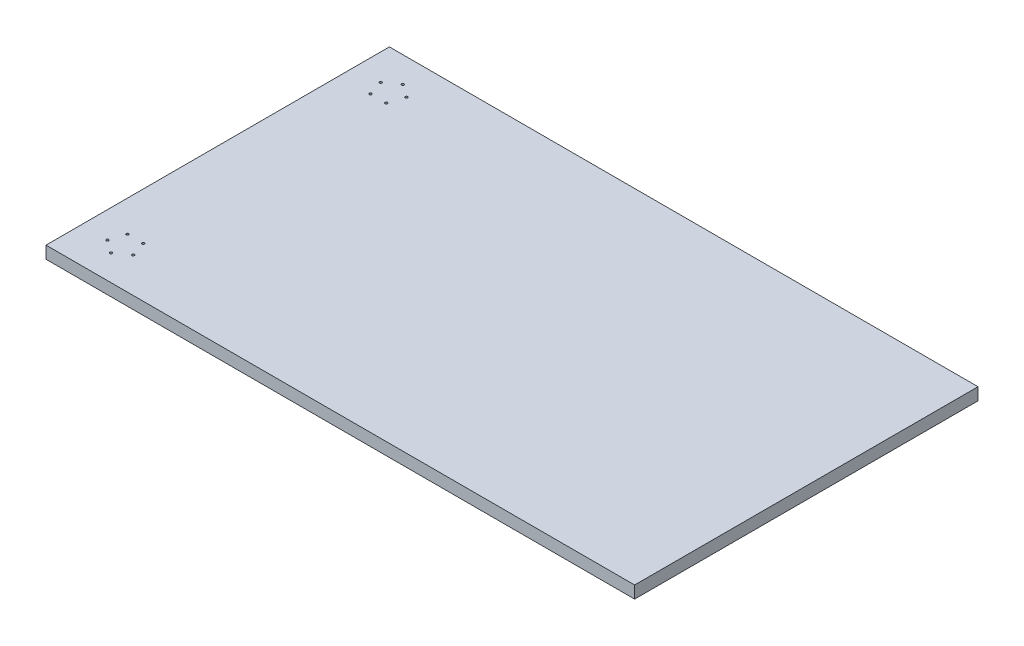
ISO-10303-21;
HEADER;
FILE_DESCRIPTION(('STEP AP214'),'2;1');
FILE_NAME('part.step','',(''),(''),'','','');
FILE_SCHEMA(('AUTOMOTIVE_DESIGN { 1 0 10303 214 1 1 1 1 }'));
ENDSEC;
DATA;
#1=APPLICATION_CONTEXT('core data for automotive mechanical design processes');
#2=APPLICATION_PROTOCOL_DEFINITION('international standard','automotive_design',2000,#1);
#3=PRODUCT_CONTEXT('',#1,'mechanical');
#4=PRODUCT('Part','Part','',(#3));
#5=PRODUCT_RELATED_PRODUCT_CATEGORY('part','',(#4));
#6=PRODUCT_DEFINITION_FORMATION('','',#4);
#7=PRODUCT_DEFINITION_CONTEXT('part definition',#1,'design');
#8=PRODUCT_DEFINITION('design','',#6,#7);
#9=PRODUCT_DEFINITION_SHAPE('','',#8);
#10=(LENGTH_UNIT() NAMED_UNIT(*) SI_UNIT(.MILLI.,.METRE.));
#11=(NAMED_UNIT(*) PLANE_ANGLE_UNIT() SI_UNIT($,.RADIAN.));
#12=(NAMED_UNIT(*) SI_UNIT($,.STERADIAN.) SOLID_ANGLE_UNIT());
#13=UNCERTAINTY_MEASURE_WITH_UNIT(LENGTH_MEASURE(1.E-05),#10,'distance_accuracy_value','');
#14=(GEOMETRIC_REPRESENTATION_CONTEXT(3) GLOBAL_UNCERTAINTY_ASSIGNED_CONTEXT((#13)) GLOBAL_UNIT_ASSIGNED_CONTEXT((#10,
#11,#12)) REPRESENTATION_CONTEXT('',''));
#15=CARTESIAN_POINT('',(0.,0.,0.));
#16=DIRECTION('',(0.,0.,1.));
#17=DIRECTION('',(1.,0.,0.));
#18=AXIS2_PLACEMENT_3D('',#15,#16,#17);
#19=CARTESIAN_POINT('',(-600.,25.,-350.));
#20=DIRECTION('',(0.,0.,-1.));
#21=DIRECTION('',(-1.,0.,0.));
#22=AXIS2_PLACEMENT_3D('',#19,#20,#21);
#23=PLANE('',#22);
#24=DIRECTION('',(1.,0.,0.));
#25=VECTOR('',#24,1.);
#26=CARTESIAN_POINT('',(-600.,0.,-350.));
#27=LINE('',#26,#25);
#28=CARTESIAN_POINT('',(-600.,0.,-350.));
#29=VERTEX_POINT('',#28);
#30=CARTESIAN_POINT('',(600.,0.,-350.));
#31=VERTEX_POINT('',#30);
#32=EDGE_CURVE('E176',#29,#31,#27,.T.);
#33=ORIENTED_EDGE('',*,*,#32,.F.);
#34=DIRECTION('',(0.,-1.,0.));
#35=VECTOR('',#34,1.);
#36=CARTESIAN_POINT('',(-600.,25.,-350.));
#37=LINE('',#36,#35);
#38=CARTESIAN_POINT('',(-600.,25.,-350.));
#39=VERTEX_POINT('',#38);
#40=EDGE_CURVE('E11',#39,#29,#37,.T.);
#41=ORIENTED_EDGE('',*,*,#40,.F.);
#42=DIRECTION('',(1.,0.,0.));
#43=VECTOR('',#42,1.);
#44=CARTESIAN_POINT('',(-600.,25.,-350.));
#45=LINE('',#44,#43);
#46=CARTESIAN_POINT('',(600.,25.,-350.));
#47=VERTEX_POINT('',#46);
#48=EDGE_CURVE('E177',#39,#47,#45,.T.);
#49=ORIENTED_EDGE('',*,*,#48,.T.);
#50=DIRECTION('',(0.,-1.,0.));
#51=VECTOR('',#50,1.);
#52=CARTESIAN_POINT('',(600.,25.,-350.));
#53=LINE('',#52,#51);
#54=EDGE_CURVE('E35',#47,#31,#53,.T.);
#55=ORIENTED_EDGE('',*,*,#54,.T.);
#56=EDGE_LOOP('',(#33,#41,#49,#55));
#57=FACE_BOUND('',#56,.T.);
#58=ADVANCED_FACE('F32',(#57),#23,.T.);
#59=CARTESIAN_POINT('',(-600.,25.,350.));
#60=DIRECTION('',(-1.,0.,0.));
#61=DIRECTION('',(0.,0.,1.));
#62=AXIS2_PLACEMENT_3D('',#59,#60,#61);
#63=PLANE('',#62);
#64=DIRECTION('',(0.,0.,-1.));
#65=VECTOR('',#64,1.);
#66=CARTESIAN_POINT('',(-600.,0.,350.));
#67=LINE('',#66,#65);
#68=CARTESIAN_POINT('',(-600.,0.,350.));
#69=VERTEX_POINT('',#68);
#70=EDGE_CURVE('E179',#69,#29,#67,.T.);
#71=ORIENTED_EDGE('',*,*,#70,.F.);
#72=DIRECTION('',(0.,-1.,0.));
#73=VECTOR('',#72,1.);
#74=CARTESIAN_POINT('',(-600.,25.,350.));
#75=LINE('',#74,#73);
#76=CARTESIAN_POINT('',(-600.,25.,350.));
#77=VERTEX_POINT('',#76);
#78=EDGE_CURVE('E41',#77,#69,#75,.T.);
#79=ORIENTED_EDGE('',*,*,#78,.F.);
#80=DIRECTION('',(0.,0.,-1.));
#81=VECTOR('',#80,1.);
#82=CARTESIAN_POINT('',(-600.,25.,350.));
#83=LINE('',#82,#81);
#84=EDGE_CURVE('E183',#77,#39,#83,.T.);
#85=ORIENTED_EDGE('',*,*,#84,.T.);
#86=ORIENTED_EDGE('',*,*,#40,.T.);
#87=EDGE_LOOP('',(#71,#79,#85,#86));
#88=FACE_BOUND('',#87,.T.);
#89=ADVANCED_FACE('F202',(#88),#63,.T.);
#90=CARTESIAN_POINT('',(-600.,25.,350.));
#91=DIRECTION('',(0.,0.,-1.));
#92=DIRECTION('',(-1.,0.,0.));
#93=AXIS2_PLACEMENT_3D('',#90,#91,#92);
#94=PLANE('',#93);
#95=DIRECTION('',(1.,0.,0.));
#96=VECTOR('',#95,1.);
#97=CARTESIAN_POINT('',(-600.,0.,350.));
#98=LINE('',#97,#96);
#99=CARTESIAN_POINT('',(600.,0.,350.));
#100=VERTEX_POINT('',#99);
#101=EDGE_CURVE('E190',#69,#100,#98,.T.);
#102=ORIENTED_EDGE('',*,*,#101,.T.);
#103=DIRECTION('',(0.,-1.,0.));
#104=VECTOR('',#103,1.);
#105=CARTESIAN_POINT('',(600.,25.,350.));
#106=LINE('',#105,#104);
#107=CARTESIAN_POINT('',(600.,25.,350.));
#108=VERTEX_POINT('',#107);
#109=EDGE_CURVE('E194',#108,#100,#106,.T.);
#110=ORIENTED_EDGE('',*,*,#109,.F.);
#111=DIRECTION('',(1.,0.,0.));
#112=VECTOR('',#111,1.);
#113=CARTESIAN_POINT('',(-600.,25.,350.));
#114=LINE('',#113,#112);
#115=EDGE_CURVE('E181',#77,#108,#114,.T.);
#116=ORIENTED_EDGE('',*,*,#115,.F.);
#117=ORIENTED_EDGE('',*,*,#78,.T.);
#118=EDGE_LOOP('',(#102,#110,#116,#117));
#119=FACE_BOUND('',#118,.T.);
#120=ADVANCED_FACE('F204',(#119),#94,.F.);
#121=CARTESIAN_POINT('',(600.,25.,350.));
#122=DIRECTION('',(-1.,0.,0.));
#123=DIRECTION('',(0.,0.,1.));
#124=AXIS2_PLACEMENT_3D('',#121,#122,#123);
#125=PLANE('',#124);
#126=DIRECTION('',(0.,0.,-1.));
#127=VECTOR('',#126,1.);
#128=CARTESIAN_POINT('',(600.,0.,350.));
#129=LINE('',#128,#127);
#130=EDGE_CURVE('E187',#100,#31,#129,.T.);
#131=ORIENTED_EDGE('',*,*,#130,.T.);
#132=ORIENTED_EDGE('',*,*,#54,.F.);
#133=DIRECTION('',(0.,0.,-1.));
#134=VECTOR('',#133,1.);
#135=CARTESIAN_POINT('',(600.,25.,350.));
#136=LINE('',#135,#134);
#137=EDGE_CURVE('E75',#108,#47,#136,.T.);
#138=ORIENTED_EDGE('',*,*,#137,.F.);
#139=ORIENTED_EDGE('',*,*,#109,.T.);
#140=EDGE_LOOP('',(#131,#132,#138,#139));
#141=FACE_BOUND('',#140,.T.);
#142=ADVANCED_FACE('F199',(#141),#125,.F.);
#143=CARTESIAN_POINT('',(0.,25.,0.));
#144=DIRECTION('',(0.,1.,0.));
#145=DIRECTION('',(0.,0.,1.));
#146=AXIS2_PLACEMENT_3D('',#143,#144,#145);
#147=PLANE('',#146);
#148=CARTESIAN_POINT('',(-493.845945801883,25.,-278.497967345312));
#149=DIRECTION('',(0.,1.,0.));
#150=DIRECTION('',(0.,0.,1.));
#151=AXIS2_PLACEMENT_3D('',#148,#149,#150);
#152=CIRCLE('',#151,2.5);
#153=CARTESIAN_POINT('',(-493.845945801883,25.,-275.997967345312));
#154=VERTEX_POINT('',#153);
#155=EDGE_CURVE('E118',#154,#154,#152,.T.);
#156=ORIENTED_EDGE('',*,*,#155,.F.);
#157=EDGE_LOOP('',(#156));
#158=FACE_BOUND('',#157,.T.);
#159=CARTESIAN_POINT('',(-520.,25.,-297.5));
#160=DIRECTION('',(0.,1.,0.));
#161=DIRECTION('',(0.,0.,1.));
#162=AXIS2_PLACEMENT_3D('',#159,#160,#161);
#163=CIRCLE('',#162,2.49999999999995);
#164=CARTESIAN_POINT('',(-520.,25.,-295.));
#165=VERTEX_POINT('',#164);
#166=EDGE_CURVE('E117',#165,#165,#163,.T.);
#167=ORIENTED_EDGE('',*,*,#166,.F.);
#168=EDGE_LOOP('',(#167));
#169=FACE_BOUND('',#168,.T.);
#170=CARTESIAN_POINT('',(-546.154054198116,25.,-278.49796734531));
#171=DIRECTION('',(0.,1.,0.));
#172=DIRECTION('',(0.,0.,1.));
#173=AXIS2_PLACEMENT_3D('',#170,#171,#172);
#174=CIRCLE('',#173,2.49999999999995);
#175=CARTESIAN_POINT('',(-546.154054198116,25.,-275.99796734531));
#176=VERTEX_POINT('',#175);
#177=EDGE_CURVE('E128',#176,#176,#174,.T.);
#178=ORIENTED_EDGE('',*,*,#177,.F.);
#179=EDGE_LOOP('',(#178));
#180=FACE_BOUND('',#179,.T.);
#181=CARTESIAN_POINT('',(-536.164094438041,25.,-247.752032654688));
#182=DIRECTION('',(0.,1.,0.));
#183=DIRECTION('',(0.,0.,1.));
#184=AXIS2_PLACEMENT_3D('',#181,#182,#183);
#185=CIRCLE('',#184,2.49999999999995);
#186=CARTESIAN_POINT('',(-536.164094438041,25.,-245.252032654688));
#187=VERTEX_POINT('',#186);
#188=EDGE_CURVE('E134',#187,#187,#185,.T.);
#189=ORIENTED_EDGE('',*,*,#188,.F.);
#190=EDGE_LOOP('',(#189));
#191=FACE_BOUND('',#190,.T.);
#192=CARTESIAN_POINT('',(-503.835905561955,25.,-247.752032654689));
#193=DIRECTION('',(0.,1.,0.));
#194=DIRECTION('',(0.,0.,1.));
#195=AXIS2_PLACEMENT_3D('',#192,#193,#194);
#196=CIRCLE('',#195,2.49999999999995);
#197=CARTESIAN_POINT('',(-503.835905561955,25.,-245.25203265469));
#198=VERTEX_POINT('',#197);
#199=EDGE_CURVE('E140',#198,#198,#196,.T.);
#200=ORIENTED_EDGE('',*,*,#199,.F.);
#201=EDGE_LOOP('',(#200));
#202=FACE_BOUND('',#201,.T.);
#203=CARTESIAN_POINT('',(-493.845945801883,25.,278.497967345312));
#204=DIRECTION('',(0.,1.,0.));
#205=DIRECTION('',(0.,0.,1.));
#206=AXIS2_PLACEMENT_3D('',#203,#204,#205);
#207=CIRCLE('',#206,2.5);
#208=CARTESIAN_POINT('',(-493.845945801883,25.,280.997967345312));
#209=VERTEX_POINT('',#208);
#210=EDGE_CURVE('E146',#209,#209,#207,.T.);
#211=ORIENTED_EDGE('',*,*,#210,.F.);
#212=EDGE_LOOP('',(#211));
#213=FACE_BOUND('',#212,.T.);
#214=CARTESIAN_POINT('',(-503.835905561955,25.,247.752032654689));
#215=DIRECTION('',(0.,1.,0.));
#216=DIRECTION('',(0.,0.,1.));
#217=AXIS2_PLACEMENT_3D('',#214,#215,#216);
#218=CIRCLE('',#217,2.49999999999995);
#219=CARTESIAN_POINT('',(-503.835905561955,25.,250.252032654689));
#220=VERTEX_POINT('',#219);
#221=EDGE_CURVE('E152',#220,#220,#218,.T.);
#222=ORIENTED_EDGE('',*,*,#221,.F.);
#223=EDGE_LOOP('',(#222));
#224=FACE_BOUND('',#223,.T.);
#225=CARTESIAN_POINT('',(-536.164094438041,25.,247.752032654688));
#226=DIRECTION('',(0.,1.,0.));
#227=DIRECTION('',(0.,0.,1.));
#228=AXIS2_PLACEMENT_3D('',#225,#226,#227);
#229=CIRCLE('',#228,2.49999999999995);
#230=CARTESIAN_POINT('',(-536.164094438041,25.,250.252032654688));
#231=VERTEX_POINT('',#230);
#232=EDGE_CURVE('E158',#231,#231,#229,.T.);
#233=ORIENTED_EDGE('',*,*,#232,.F.);
#234=EDGE_LOOP('',(#233));
#235=FACE_BOUND('',#234,.T.);
#236=CARTESIAN_POINT('',(-546.154054198116,25.,278.49796734531));
#237=DIRECTION('',(0.,1.,0.));
#238=DIRECTION('',(0.,0.,1.));
#239=AXIS2_PLACEMENT_3D('',#236,#237,#238);
#240=CIRCLE('',#239,2.49999999999995);
#241=CARTESIAN_POINT('',(-546.154054198116,25.,280.99796734531));
#242=VERTEX_POINT('',#241);
#243=EDGE_CURVE('E164',#242,#242,#240,.T.);
#244=ORIENTED_EDGE('',*,*,#243,.F.);
#245=EDGE_LOOP('',(#244));
#246=FACE_BOUND('',#245,.T.);
#247=CARTESIAN_POINT('',(-520.,25.,297.5));
#248=DIRECTION('',(0.,1.,0.));
#249=DIRECTION('',(0.,0.,1.));
#250=AXIS2_PLACEMENT_3D('',#247,#248,#249);
#251=CIRCLE('',#250,2.49999999999995);
#252=CARTESIAN_POINT('',(-520.,25.,300.));
#253=VERTEX_POINT('',#252);
#254=EDGE_CURVE('E170',#253,#253,#251,.T.);
#255=ORIENTED_EDGE('',*,*,#254,.F.);
#256=EDGE_LOOP('',(#255));
#257=FACE_BOUND('',#256,.T.);
#258=ORIENTED_EDGE('',*,*,#48,.F.);
#259=ORIENTED_EDGE('',*,*,#84,.F.);
#260=ORIENTED_EDGE('',*,*,#115,.T.);
#261=ORIENTED_EDGE('',*,*,#137,.T.);
#262=EDGE_LOOP('',(#258,#259,#260,#261));
#263=FACE_BOUND('',#262,.T.);
#264=ADVANCED_FACE('F205',(#158,#169,#180,#191,#202,#213,#224,#235,#246,#257,#263),#147,.T.);
#265=CARTESIAN_POINT('',(0.,0.,0.));
#266=DIRECTION('',(0.,1.,0.));
#267=DIRECTION('',(0.,0.,1.));
#268=AXIS2_PLACEMENT_3D('',#265,#266,#267);
#269=PLANE('',#268);
#270=ORIENTED_EDGE('',*,*,#32,.T.);
#271=ORIENTED_EDGE('',*,*,#130,.F.);
#272=ORIENTED_EDGE('',*,*,#101,.F.);
#273=ORIENTED_EDGE('',*,*,#70,.T.);
#274=EDGE_LOOP('',(#270,#271,#272,#273));
#275=FACE_BOUND('',#274,.T.);
#276=ADVANCED_FACE('F201',(#275),#269,.F.);
#277=CARTESIAN_POINT('',(-520.,10.,297.5));
#278=DIRECTION('',(0.,1.,0.));
#279=DIRECTION('',(0.,0.,1.));
#280=AXIS2_PLACEMENT_3D('',#277,#278,#279);
#281=CONICAL_SURFACE('',#280,2.49999999999995,1.02974425867665);
#282=CARTESIAN_POINT('',(-520.,8.4978484524311,297.5));
#283=VERTEX_POINT('',#282);
#284=VERTEX_LOOP('',#283);
#285=FACE_BOUND('',#284,.T.);
#286=CARTESIAN_POINT('',(-520.,10.,297.5));
#287=DIRECTION('',(0.,1.,0.));
#288=DIRECTION('',(0.,0.,1.));
#289=AXIS2_PLACEMENT_3D('',#286,#287,#288);
#290=CIRCLE('',#289,2.49999999999995);
#291=CARTESIAN_POINT('',(-520.,10.,300.));
#292=VERTEX_POINT('',#291);
#293=EDGE_CURVE('E173',#292,#292,#290,.T.);
#294=ORIENTED_EDGE('',*,*,#293,.T.);
#295=EDGE_LOOP('',(#294));
#296=FACE_BOUND('',#295,.T.);
#297=ADVANCED_FACE('F214',(#285,#296),#281,.F.);
#298=CARTESIAN_POINT('',(-520.,25.,297.5));
#299=DIRECTION('',(0.,1.,0.));
#300=DIRECTION('',(0.,0.,1.));
#301=AXIS2_PLACEMENT_3D('',#298,#299,#300);
#302=CYLINDRICAL_SURFACE('',#301,2.49999999999995);
#303=ORIENTED_EDGE('',*,*,#293,.F.);
#304=EDGE_LOOP('',(#303));
#305=FACE_BOUND('',#304,.T.);
#306=ORIENTED_EDGE('',*,*,#254,.T.);
#307=EDGE_LOOP('',(#306));
#308=FACE_BOUND('',#307,.T.);
#309=ADVANCED_FACE('F247',(#305,#308),#302,.F.);
#310=CARTESIAN_POINT('',(-546.154054198116,10.,278.49796734531));
#311=DIRECTION('',(0.,1.,0.));
#312=DIRECTION('',(0.,0.,1.));
#313=AXIS2_PLACEMENT_3D('',#310,#311,#312);
#314=CONICAL_SURFACE('',#313,2.49999999999995,1.02974425867665);
#315=CARTESIAN_POINT('',(-546.154054198116,8.4978484524311,278.49796734531));
#316=VERTEX_POINT('',#315);
#317=VERTEX_LOOP('',#316);
#318=FACE_BOUND('',#317,.T.);
#319=CARTESIAN_POINT('',(-546.154054198116,10.,278.49796734531));
#320=DIRECTION('',(0.,1.,0.));
#321=DIRECTION('',(0.,0.,1.));
#322=AXIS2_PLACEMENT_3D('',#319,#320,#321);
#323=CIRCLE('',#322,2.49999999999995);
#324=CARTESIAN_POINT('',(-546.154054198116,10.,280.99796734531));
#325=VERTEX_POINT('',#324);
#326=EDGE_CURVE('E167',#325,#325,#323,.T.);
#327=ORIENTED_EDGE('',*,*,#326,.T.);
#328=EDGE_LOOP('',(#327));
#329=FACE_BOUND('',#328,.T.);
#330=ADVANCED_FACE('F254',(#318,#329),#314,.F.);
#331=CARTESIAN_POINT('',(-546.154054198116,25.,278.49796734531));
#332=DIRECTION('',(0.,1.,0.));
#333=DIRECTION('',(0.,0.,1.));
#334=AXIS2_PLACEMENT_3D('',#331,#332,#333);
#335=CYLINDRICAL_SURFACE('',#334,2.49999999999995);
#336=ORIENTED_EDGE('',*,*,#326,.F.);
#337=EDGE_LOOP('',(#336));
#338=FACE_BOUND('',#337,.T.);
#339=ORIENTED_EDGE('',*,*,#243,.T.);
#340=EDGE_LOOP('',(#339));
#341=FACE_BOUND('',#340,.T.);
#342=ADVANCED_FACE('F262',(#338,#341),#335,.F.);
#343=CARTESIAN_POINT('',(-536.164094438041,10.,247.752032654688));
#344=DIRECTION('',(0.,1.,0.));
#345=DIRECTION('',(0.,0.,1.));
#346=AXIS2_PLACEMENT_3D('',#343,#344,#345);
#347=CONICAL_SURFACE('',#346,2.49999999999995,1.02974425867665);
#348=CARTESIAN_POINT('',(-536.164094438041,8.4978484524311,247.752032654688));
#349=VERTEX_POINT('',#348);
#350=VERTEX_LOOP('',#349);
#351=FACE_BOUND('',#350,.T.);
#352=CARTESIAN_POINT('',(-536.164094438041,10.,247.752032654688));
#353=DIRECTION('',(0.,1.,0.));
#354=DIRECTION('',(0.,0.,1.));
#355=AXIS2_PLACEMENT_3D('',#352,#353,#354);
#356=CIRCLE('',#355,2.49999999999995);
#357=CARTESIAN_POINT('',(-536.164094438041,10.,250.252032654688));
#358=VERTEX_POINT('',#357);
#359=EDGE_CURVE('E161',#358,#358,#356,.T.);
#360=ORIENTED_EDGE('',*,*,#359,.T.);
#361=EDGE_LOOP('',(#360));
#362=FACE_BOUND('',#361,.T.);
#363=ADVANCED_FACE('F270',(#351,#362),#347,.F.);
#364=CARTESIAN_POINT('',(-536.164094438041,25.,247.752032654688));
#365=DIRECTION('',(0.,1.,0.));
#366=DIRECTION('',(0.,0.,1.));
#367=AXIS2_PLACEMENT_3D('',#364,#365,#366);
#368=CYLINDRICAL_SURFACE('',#367,2.49999999999995);
#369=ORIENTED_EDGE('',*,*,#359,.F.);
#370=EDGE_LOOP('',(#369));
#371=FACE_BOUND('',#370,.T.);
#372=ORIENTED_EDGE('',*,*,#232,.T.);
#373=EDGE_LOOP('',(#372));
#374=FACE_BOUND('',#373,.T.);
#375=ADVANCED_FACE('F278',(#371,#374),#368,.F.);
#376=CARTESIAN_POINT('',(-503.835905561955,10.,247.752032654689));
#377=DIRECTION('',(0.,1.,0.));
#378=DIRECTION('',(0.,0.,1.));
#379=AXIS2_PLACEMENT_3D('',#376,#377,#378);
#380=CONICAL_SURFACE('',#379,2.49999999999995,1.02974425867665);
#381=CARTESIAN_POINT('',(-503.835905561955,8.4978484524311,247.752032654689));
#382=VERTEX_POINT('',#381);
#383=VERTEX_LOOP('',#382);
#384=FACE_BOUND('',#383,.T.);
#385=CARTESIAN_POINT('',(-503.835905561955,10.,247.752032654689));
#386=DIRECTION('',(0.,1.,0.));
#387=DIRECTION('',(0.,0.,1.));
#388=AXIS2_PLACEMENT_3D('',#385,#386,#387);
#389=CIRCLE('',#388,2.49999999999995);
#390=CARTESIAN_POINT('',(-503.835905561955,10.,250.252032654689));
#391=VERTEX_POINT('',#390);
#392=EDGE_CURVE('E155',#391,#391,#389,.T.);
#393=ORIENTED_EDGE('',*,*,#392,.T.);
#394=EDGE_LOOP('',(#393));
#395=FACE_BOUND('',#394,.T.);
#396=ADVANCED_FACE('F286',(#384,#395),#380,.F.);
#397=CARTESIAN_POINT('',(-503.835905561955,25.,247.752032654689));
#398=DIRECTION('',(0.,1.,0.));
#399=DIRECTION('',(0.,0.,1.));
#400=AXIS2_PLACEMENT_3D('',#397,#398,#399);
#401=CYLINDRICAL_SURFACE('',#400,2.49999999999995);
#402=ORIENTED_EDGE('',*,*,#392,.F.);
#403=EDGE_LOOP('',(#402));
#404=FACE_BOUND('',#403,.T.);
#405=ORIENTED_EDGE('',*,*,#221,.T.);
#406=EDGE_LOOP('',(#405));
#407=FACE_BOUND('',#406,.T.);
#408=ADVANCED_FACE('F294',(#404,#407),#401,.F.);
#409=CARTESIAN_POINT('',(-493.845945801883,10.,278.497967345312));
#410=DIRECTION('',(0.,1.,0.));
#411=DIRECTION('',(0.,0.,1.));
#412=AXIS2_PLACEMENT_3D('',#409,#410,#411);
#413=CONICAL_SURFACE('',#412,2.5,1.02974425867666);
#414=CARTESIAN_POINT('',(-493.845945801883,8.4978484524311,278.497967345312));
#415=VERTEX_POINT('',#414);
#416=VERTEX_LOOP('',#415);
#417=FACE_BOUND('',#416,.T.);
#418=CARTESIAN_POINT('',(-493.845945801883,10.,278.497967345312));
#419=DIRECTION('',(0.,1.,0.));
#420=DIRECTION('',(0.,0.,1.));
#421=AXIS2_PLACEMENT_3D('',#418,#419,#420);
#422=CIRCLE('',#421,2.5);
#423=CARTESIAN_POINT('',(-493.845945801883,10.,280.997967345312));
#424=VERTEX_POINT('',#423);
#425=EDGE_CURVE('E149',#424,#424,#422,.T.);
#426=ORIENTED_EDGE('',*,*,#425,.T.);
#427=EDGE_LOOP('',(#426));
#428=FACE_BOUND('',#427,.T.);
#429=ADVANCED_FACE('F302',(#417,#428),#413,.F.);
#430=CARTESIAN_POINT('',(-493.845945801883,25.,278.497967345312));
#431=DIRECTION('',(0.,1.,0.));
#432=DIRECTION('',(0.,0.,1.));
#433=AXIS2_PLACEMENT_3D('',#430,#431,#432);
#434=CYLINDRICAL_SURFACE('',#433,2.5);
#435=ORIENTED_EDGE('',*,*,#425,.F.);
#436=EDGE_LOOP('',(#435));
#437=FACE_BOUND('',#436,.T.);
#438=ORIENTED_EDGE('',*,*,#210,.T.);
#439=EDGE_LOOP('',(#438));
#440=FACE_BOUND('',#439,.T.);
#441=ADVANCED_FACE('F310',(#437,#440),#434,.F.);
#442=CARTESIAN_POINT('',(-503.835905561955,10.,-247.752032654689));
#443=DIRECTION('',(0.,1.,0.));
#444=DIRECTION('',(0.,0.,1.));
#445=AXIS2_PLACEMENT_3D('',#442,#443,#444);
#446=CONICAL_SURFACE('',#445,2.49999999999995,1.02974425867665);
#447=CARTESIAN_POINT('',(-503.835905561955,8.4978484524311,-247.752032654689));
#448=VERTEX_POINT('',#447);
#449=VERTEX_LOOP('',#448);
#450=FACE_BOUND('',#449,.T.);
#451=CARTESIAN_POINT('',(-503.835905561955,10.,-247.752032654689));
#452=DIRECTION('',(0.,1.,0.));
#453=DIRECTION('',(0.,0.,1.));
#454=AXIS2_PLACEMENT_3D('',#451,#452,#453);
#455=CIRCLE('',#454,2.49999999999995);
#456=CARTESIAN_POINT('',(-503.835905561955,10.,-245.25203265469));
#457=VERTEX_POINT('',#456);
#458=EDGE_CURVE('E143',#457,#457,#455,.T.);
#459=ORIENTED_EDGE('',*,*,#458,.T.);
#460=EDGE_LOOP('',(#459));
#461=FACE_BOUND('',#460,.T.);
#462=ADVANCED_FACE('F318',(#450,#461),#446,.F.);
#463=CARTESIAN_POINT('',(-503.835905561955,25.,-247.752032654689));
#464=DIRECTION('',(0.,1.,0.));
#465=DIRECTION('',(0.,0.,1.));
#466=AXIS2_PLACEMENT_3D('',#463,#464,#465);
#467=CYLINDRICAL_SURFACE('',#466,2.49999999999995);
#468=ORIENTED_EDGE('',*,*,#458,.F.);
#469=EDGE_LOOP('',(#468));
#470=FACE_BOUND('',#469,.T.);
#471=ORIENTED_EDGE('',*,*,#199,.T.);
#472=EDGE_LOOP('',(#471));
#473=FACE_BOUND('',#472,.T.);
#474=ADVANCED_FACE('F326',(#470,#473),#467,.F.);
#475=CARTESIAN_POINT('',(-536.164094438041,10.,-247.752032654688));
#476=DIRECTION('',(0.,1.,0.));
#477=DIRECTION('',(0.,0.,1.));
#478=AXIS2_PLACEMENT_3D('',#475,#476,#477);
#479=CONICAL_SURFACE('',#478,2.49999999999995,1.02974425867665);
#480=CARTESIAN_POINT('',(-536.164094438041,8.4978484524311,-247.752032654688));
#481=VERTEX_POINT('',#480);
#482=VERTEX_LOOP('',#481);
#483=FACE_BOUND('',#482,.T.);
#484=CARTESIAN_POINT('',(-536.164094438041,10.,-247.752032654688));
#485=DIRECTION('',(0.,1.,0.));
#486=DIRECTION('',(0.,0.,1.));
#487=AXIS2_PLACEMENT_3D('',#484,#485,#486);
#488=CIRCLE('',#487,2.49999999999995);
#489=CARTESIAN_POINT('',(-536.164094438041,10.,-245.252032654688));
#490=VERTEX_POINT('',#489);
#491=EDGE_CURVE('E137',#490,#490,#488,.T.);
#492=ORIENTED_EDGE('',*,*,#491,.T.);
#493=EDGE_LOOP('',(#492));
#494=FACE_BOUND('',#493,.T.);
#495=ADVANCED_FACE('F334',(#483,#494),#479,.F.);
#496=CARTESIAN_POINT('',(-536.164094438041,25.,-247.752032654688));
#497=DIRECTION('',(0.,1.,0.));
#498=DIRECTION('',(0.,0.,1.));
#499=AXIS2_PLACEMENT_3D('',#496,#497,#498);
#500=CYLINDRICAL_SURFACE('',#499,2.49999999999995);
#501=ORIENTED_EDGE('',*,*,#491,.F.);
#502=EDGE_LOOP('',(#501));
#503=FACE_BOUND('',#502,.T.);
#504=ORIENTED_EDGE('',*,*,#188,.T.);
#505=EDGE_LOOP('',(#504));
#506=FACE_BOUND('',#505,.T.);
#507=ADVANCED_FACE('F342',(#503,#506),#500,.F.);
#508=CARTESIAN_POINT('',(-546.154054198116,10.,-278.49796734531));
#509=DIRECTION('',(0.,1.,0.));
#510=DIRECTION('',(0.,0.,1.));
#511=AXIS2_PLACEMENT_3D('',#508,#509,#510);
#512=CONICAL_SURFACE('',#511,2.49999999999995,1.02974425867665);
#513=CARTESIAN_POINT('',(-546.154054198116,8.4978484524311,-278.49796734531));
#514=VERTEX_POINT('',#513);
#515=VERTEX_LOOP('',#514);
#516=FACE_BOUND('',#515,.T.);
#517=CARTESIAN_POINT('',(-546.154054198116,10.,-278.49796734531));
#518=DIRECTION('',(0.,1.,0.));
#519=DIRECTION('',(0.,0.,1.));
#520=AXIS2_PLACEMENT_3D('',#517,#518,#519);
#521=CIRCLE('',#520,2.49999999999995);
#522=CARTESIAN_POINT('',(-546.154054198116,10.,-275.99796734531));
#523=VERTEX_POINT('',#522);
#524=EDGE_CURVE('E131',#523,#523,#521,.T.);
#525=ORIENTED_EDGE('',*,*,#524,.T.);
#526=EDGE_LOOP('',(#525));
#527=FACE_BOUND('',#526,.T.);
#528=ADVANCED_FACE('F350',(#516,#527),#512,.F.);
#529=CARTESIAN_POINT('',(-546.154054198116,25.,-278.49796734531));
#530=DIRECTION('',(0.,1.,0.));
#531=DIRECTION('',(0.,0.,1.));
#532=AXIS2_PLACEMENT_3D('',#529,#530,#531);
#533=CYLINDRICAL_SURFACE('',#532,2.49999999999995);
#534=ORIENTED_EDGE('',*,*,#524,.F.);
#535=EDGE_LOOP('',(#534));
#536=FACE_BOUND('',#535,.T.);
#537=ORIENTED_EDGE('',*,*,#177,.T.);
#538=EDGE_LOOP('',(#537));
#539=FACE_BOUND('',#538,.T.);
#540=ADVANCED_FACE('F358',(#536,#539),#533,.F.);
#541=CARTESIAN_POINT('',(-520.,10.,-297.5));
#542=DIRECTION('',(0.,1.,0.));
#543=DIRECTION('',(0.,0.,1.));
#544=AXIS2_PLACEMENT_3D('',#541,#542,#543);
#545=CONICAL_SURFACE('',#544,2.49999999999995,1.02974425867665);
#546=CARTESIAN_POINT('',(-520.,8.4978484524311,-297.5));
#547=VERTEX_POINT('',#546);
#548=VERTEX_LOOP('',#547);
#549=FACE_BOUND('',#548,.T.);
#550=CARTESIAN_POINT('',(-520.,10.,-297.5));
#551=DIRECTION('',(0.,1.,0.));
#552=DIRECTION('',(0.,0.,1.));
#553=AXIS2_PLACEMENT_3D('',#550,#551,#552);
#554=CIRCLE('',#553,2.49999999999995);
#555=CARTESIAN_POINT('',(-520.,10.,-295.));
#556=VERTEX_POINT('',#555);
#557=EDGE_CURVE('E121',#556,#556,#554,.T.);
#558=ORIENTED_EDGE('',*,*,#557,.T.);
#559=EDGE_LOOP('',(#558));
#560=FACE_BOUND('',#559,.T.);
#561=ADVANCED_FACE('F366',(#549,#560),#545,.F.);
#562=CARTESIAN_POINT('',(-520.,25.,-297.5));
#563=DIRECTION('',(0.,1.,0.));
#564=DIRECTION('',(0.,0.,1.));
#565=AXIS2_PLACEMENT_3D('',#562,#563,#564);
#566=CYLINDRICAL_SURFACE('',#565,2.49999999999995);
#567=ORIENTED_EDGE('',*,*,#557,.F.);
#568=EDGE_LOOP('',(#567));
#569=FACE_BOUND('',#568,.T.);
#570=ORIENTED_EDGE('',*,*,#166,.T.);
#571=EDGE_LOOP('',(#570));
#572=FACE_BOUND('',#571,.T.);
#573=ADVANCED_FACE('F111',(#569,#572),#566,.F.);
#574=CARTESIAN_POINT('',(-493.845945801883,10.,-278.497967345312));
#575=DIRECTION('',(0.,1.,0.));
#576=DIRECTION('',(0.,0.,1.));
#577=AXIS2_PLACEMENT_3D('',#574,#575,#576);
#578=CONICAL_SURFACE('',#577,2.5,1.02974425867666);
#579=CARTESIAN_POINT('',(-493.845945801883,8.4978484524311,-278.497967345312));
#580=VERTEX_POINT('',#579);
#581=VERTEX_LOOP('',#580);
#582=FACE_BOUND('',#581,.T.);
#583=CARTESIAN_POINT('',(-493.845945801883,10.,-278.497967345312));
#584=DIRECTION('',(0.,1.,0.));
#585=DIRECTION('',(0.,0.,1.));
#586=AXIS2_PLACEMENT_3D('',#583,#584,#585);
#587=CIRCLE('',#586,2.5);
#588=CARTESIAN_POINT('',(-493.845945801883,10.,-275.997967345312));
#589=VERTEX_POINT('',#588);
#590=EDGE_CURVE('E115',#589,#589,#587,.T.);
#591=ORIENTED_EDGE('',*,*,#590,.T.);
#592=EDGE_LOOP('',(#591));
#593=FACE_BOUND('',#592,.T.);
#594=ADVANCED_FACE('F107',(#582,#593),#578,.F.);
#595=CARTESIAN_POINT('',(-493.845945801883,25.,-278.497967345312));
#596=DIRECTION('',(0.,1.,0.));
#597=DIRECTION('',(0.,0.,1.));
#598=AXIS2_PLACEMENT_3D('',#595,#596,#597);
#599=CYLINDRICAL_SURFACE('',#598,2.5);
#600=ORIENTED_EDGE('',*,*,#590,.F.);
#601=EDGE_LOOP('',(#600));
#602=FACE_BOUND('',#601,.T.);
#603=ORIENTED_EDGE('',*,*,#155,.T.);
#604=EDGE_LOOP('',(#603));
#605=FACE_BOUND('',#604,.T.);
#606=ADVANCED_FACE('F110',(#602,#605),#599,.F.);
#607=CLOSED_SHELL('',(#58,#89,#120,#142,#264,#276,#297,#309,#330,#342,#363,#375,#396,#408,#429,
#441,#462,#474,#495,#507,#528,#540,#561,#573,#594,#606));
#608=MANIFOLD_SOLID_BREP('B2',#607);
#609=ADVANCED_BREP_SHAPE_REPRESENTATION('',(#18,#608),#14);
#610=SHAPE_DEFINITION_REPRESENTATION(#9,#609);
ENDSEC;
END-ISO-10303-21;
